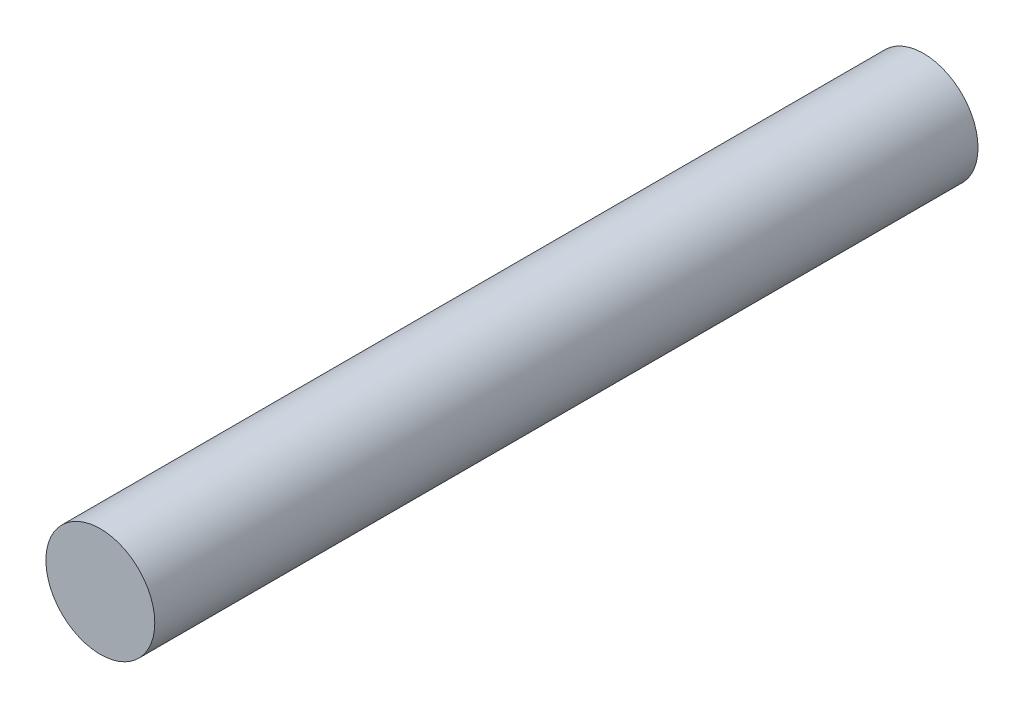
ISO-10303-21;
HEADER;
FILE_DESCRIPTION(('STEP AP214'),'2;1');
FILE_NAME('part.step','',(''),(''),'','','');
FILE_SCHEMA(('AUTOMOTIVE_DESIGN { 1 0 10303 214 1 1 1 1 }'));
ENDSEC;
DATA;
#1=APPLICATION_CONTEXT('core data for automotive mechanical design processes');
#2=APPLICATION_PROTOCOL_DEFINITION('international standard','automotive_design',2000,#1);
#3=PRODUCT_CONTEXT('',#1,'mechanical');
#4=PRODUCT('Part','Part','',(#3));
#5=PRODUCT_RELATED_PRODUCT_CATEGORY('part','',(#4));
#6=PRODUCT_DEFINITION_FORMATION('','',#4);
#7=PRODUCT_DEFINITION_CONTEXT('part definition',#1,'design');
#8=PRODUCT_DEFINITION('design','',#6,#7);
#9=PRODUCT_DEFINITION_SHAPE('','',#8);
#10=(LENGTH_UNIT() NAMED_UNIT(*) SI_UNIT(.MILLI.,.METRE.));
#11=(NAMED_UNIT(*) PLANE_ANGLE_UNIT() SI_UNIT($,.RADIAN.));
#12=(NAMED_UNIT(*) SI_UNIT($,.STERADIAN.) SOLID_ANGLE_UNIT());
#13=UNCERTAINTY_MEASURE_WITH_UNIT(LENGTH_MEASURE(1.E-05),#10,'distance_accuracy_value','');
#14=(GEOMETRIC_REPRESENTATION_CONTEXT(3) GLOBAL_UNCERTAINTY_ASSIGNED_CONTEXT((#13)) GLOBAL_UNIT_ASSIGNED_CONTEXT((#10,
#11,#12)) REPRESENTATION_CONTEXT('',''));
#15=CARTESIAN_POINT('',(0.,0.,0.));
#16=DIRECTION('',(0.,0.,1.));
#17=DIRECTION('',(1.,0.,0.));
#18=AXIS2_PLACEMENT_3D('',#15,#16,#17);
#19=CARTESIAN_POINT('',(0.,0.,22.68));
#20=DIRECTION('',(0.,0.,-1.));
#21=DIRECTION('',(-1.,0.,0.));
#22=AXIS2_PLACEMENT_3D('',#19,#20,#21);
#23=CYLINDRICAL_SURFACE('',#22,1.5);
#24=CARTESIAN_POINT('',(0.,0.,22.68));
#25=DIRECTION('',(0.,0.,1.));
#26=DIRECTION('',(1.,0.,0.));
#27=AXIS2_PLACEMENT_3D('',#24,#25,#26);
#28=CIRCLE('',#27,1.5);
#29=CARTESIAN_POINT('',(1.5,0.,22.68));
#30=VERTEX_POINT('',#29);
#31=EDGE_CURVE('E10',#30,#30,#28,.T.);
#32=ORIENTED_EDGE('',*,*,#31,.F.);
#33=EDGE_LOOP('',(#32));
#34=FACE_BOUND('',#33,.T.);
#35=CARTESIAN_POINT('',(0.,0.,0.));
#36=DIRECTION('',(0.,0.,1.));
#37=DIRECTION('',(1.,0.,0.));
#38=AXIS2_PLACEMENT_3D('',#35,#36,#37);
#39=CIRCLE('',#38,1.5);
#40=CARTESIAN_POINT('',(1.5,0.,0.));
#41=VERTEX_POINT('',#40);
#42=EDGE_CURVE('E37',#41,#41,#39,.T.);
#43=ORIENTED_EDGE('',*,*,#42,.T.);
#44=EDGE_LOOP('',(#43));
#45=FACE_BOUND('',#44,.T.);
#46=ADVANCED_FACE('F34',(#34,#45),#23,.T.);
#47=CARTESIAN_POINT('',(0.,0.,22.68));
#48=DIRECTION('',(0.,0.,1.));
#49=DIRECTION('',(1.,0.,0.));
#50=AXIS2_PLACEMENT_3D('',#47,#48,#49);
#51=PLANE('',#50);
#52=ORIENTED_EDGE('',*,*,#31,.T.);
#53=EDGE_LOOP('',(#52));
#54=FACE_BOUND('',#53,.T.);
#55=ADVANCED_FACE('F49',(#54),#51,.T.);
#56=CARTESIAN_POINT('',(0.,0.,0.));
#57=DIRECTION('',(0.,0.,1.));
#58=DIRECTION('',(1.,0.,0.));
#59=AXIS2_PLACEMENT_3D('',#56,#57,#58);
#60=PLANE('',#59);
#61=ORIENTED_EDGE('',*,*,#42,.F.);
#62=EDGE_LOOP('',(#61));
#63=FACE_BOUND('',#62,.T.);
#64=ADVANCED_FACE('F47',(#63),#60,.F.);
#65=CLOSED_SHELL('',(#46,#55,#64));
#66=MANIFOLD_SOLID_BREP('B2',#65);
#67=ADVANCED_BREP_SHAPE_REPRESENTATION('',(#18,#66),#14);
#68=SHAPE_DEFINITION_REPRESENTATION(#9,#67);
ENDSEC;
END-ISO-10303-21;
